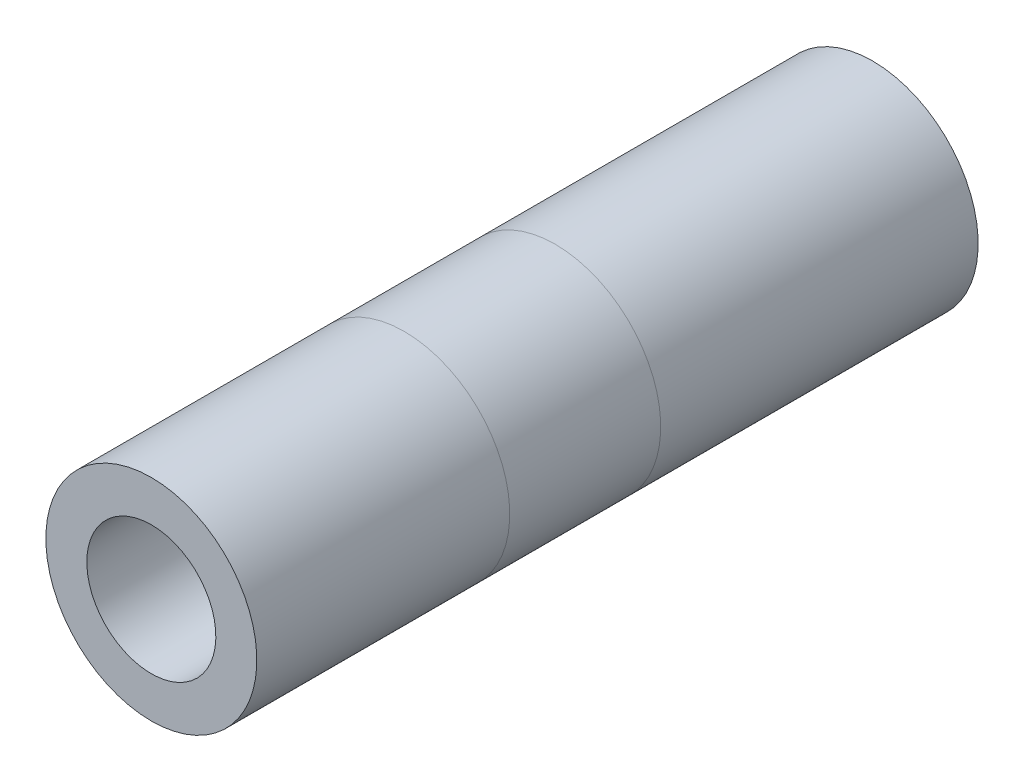
ISO-10303-21;
HEADER;
FILE_DESCRIPTION(('STEP AP214'),'2;1');
FILE_NAME('part.step','',(''),(''),'','','');
FILE_SCHEMA(('AUTOMOTIVE_DESIGN { 1 0 10303 214 1 1 1 1 }'));
ENDSEC;
DATA;
#1=APPLICATION_CONTEXT('core data for automotive mechanical design processes');
#2=APPLICATION_PROTOCOL_DEFINITION('international standard','automotive_design',2000,#1);
#3=PRODUCT_CONTEXT('',#1,'mechanical');
#4=PRODUCT('Part','Part','',(#3));
#5=PRODUCT_RELATED_PRODUCT_CATEGORY('part','',(#4));
#6=PRODUCT_DEFINITION_FORMATION('','',#4);
#7=PRODUCT_DEFINITION_CONTEXT('part definition',#1,'design');
#8=PRODUCT_DEFINITION('design','',#6,#7);
#9=PRODUCT_DEFINITION_SHAPE('','',#8);
#10=(LENGTH_UNIT() NAMED_UNIT(*) SI_UNIT(.MILLI.,.METRE.));
#11=(NAMED_UNIT(*) PLANE_ANGLE_UNIT() SI_UNIT($,.RADIAN.));
#12=(NAMED_UNIT(*) SI_UNIT($,.STERADIAN.) SOLID_ANGLE_UNIT());
#13=UNCERTAINTY_MEASURE_WITH_UNIT(LENGTH_MEASURE(1.E-05),#10,'distance_accuracy_value','');
#14=(GEOMETRIC_REPRESENTATION_CONTEXT(3) GLOBAL_UNCERTAINTY_ASSIGNED_CONTEXT((#13)) GLOBAL_UNIT_ASSIGNED_CONTEXT((#10,
#11,#12)) REPRESENTATION_CONTEXT('',''));
#15=CARTESIAN_POINT('',(0.,0.,0.));
#16=DIRECTION('',(0.,0.,1.));
#17=DIRECTION('',(1.,0.,0.));
#18=AXIS2_PLACEMENT_3D('',#15,#16,#17);
#19=CARTESIAN_POINT('',(-46.0299999999996,4.42627169165701E-13,31.3016264683147));
#20=DIRECTION('',(0.,0.,-1.));
#21=DIRECTION('',(0.,1.,0.));
#22=AXIS2_PLACEMENT_3D('',#19,#20,#21);
#23=PLANE('',#22);
#24=CARTESIAN_POINT('',(-46.0299999999996,4.42627169165701E-13,31.3016264683147));
#25=DIRECTION('',(0.,0.,-1.));
#26=DIRECTION('',(0.,1.,0.));
#27=AXIS2_PLACEMENT_3D('',#24,#25,#26);
#28=CIRCLE('',#27,5.);
#29=CARTESIAN_POINT('',(-46.0299999999996,5.00000000000044,31.3016264683147));
#30=VERTEX_POINT('',#29);
#31=EDGE_CURVE('E75',#30,#30,#28,.F.);
#32=ORIENTED_EDGE('',*,*,#31,.F.);
#33=EDGE_LOOP('',(#32));
#34=FACE_BOUND('',#33,.T.);
#35=CARTESIAN_POINT('',(-46.0299999999996,4.42627169165701E-13,31.3016264683147));
#36=DIRECTION('',(0.,0.,-1.));
#37=DIRECTION('',(0.,1.,0.));
#38=AXIS2_PLACEMENT_3D('',#35,#36,#37);
#39=CIRCLE('',#38,8.175);
#40=CARTESIAN_POINT('',(-46.0299999999996,8.17500000000044,31.3016264683147));
#41=VERTEX_POINT('',#40);
#42=EDGE_CURVE('E70',#41,#41,#39,.T.);
#43=ORIENTED_EDGE('',*,*,#42,.F.);
#44=EDGE_LOOP('',(#43));
#45=FACE_BOUND('',#44,.T.);
#46=ADVANCED_FACE('F56',(#34,#45),#23,.F.);
#47=CARTESIAN_POINT('',(-46.03,0.,-24.5999999999999));
#48=DIRECTION('',(0.,0.,-1.));
#49=DIRECTION('',(0.,1.,0.));
#50=AXIS2_PLACEMENT_3D('',#47,#48,#49);
#51=PLANE('',#50);
#52=CARTESIAN_POINT('',(-46.030000000001,-1.1393832554663E-12,-24.5999999999999));
#53=DIRECTION('',(0.,0.,-1.));
#54=DIRECTION('',(0.,1.,0.));
#55=AXIS2_PLACEMENT_3D('',#52,#53,#54);
#56=CIRCLE('',#55,5.);
#57=CARTESIAN_POINT('',(-46.030000000001,4.99999999999886,-24.5999999999999));
#58=VERTEX_POINT('',#57);
#59=EDGE_CURVE('E76',#58,#58,#56,.F.);
#60=ORIENTED_EDGE('',*,*,#59,.T.);
#61=EDGE_LOOP('',(#60));
#62=FACE_BOUND('',#61,.T.);
#63=CARTESIAN_POINT('',(-46.03,0.,-24.5999999999999));
#64=DIRECTION('',(0.,0.,-1.));
#65=DIRECTION('',(0.,1.,0.));
#66=AXIS2_PLACEMENT_3D('',#63,#64,#65);
#67=CIRCLE('',#66,8.175);
#68=CARTESIAN_POINT('',(-46.03,8.17500000000002,-24.5999999999999));
#69=VERTEX_POINT('',#68);
#70=EDGE_CURVE('E11',#69,#69,#67,.T.);
#71=ORIENTED_EDGE('',*,*,#70,.T.);
#72=EDGE_LOOP('',(#71));
#73=FACE_BOUND('',#72,.T.);
#74=ADVANCED_FACE('F93',(#62,#73),#51,.T.);
#75=CARTESIAN_POINT('',(-46.0299999999996,4.42627169165701E-13,31.3016264683147));
#76=DIRECTION('',(0.,0.,-1.));
#77=DIRECTION('',(-1.,0.,0.));
#78=AXIS2_PLACEMENT_3D('',#75,#76,#77);
#79=CYLINDRICAL_SURFACE('',#78,8.175);
#80=CARTESIAN_POINT('',(-46.0299999999996,4.32834212964584E-13,11.7000469580002));
#81=DIRECTION('',(0.,0.,-1.));
#82=DIRECTION('',(0.,1.,0.));
#83=AXIS2_PLACEMENT_3D('',#80,#81,#82);
#84=CIRCLE('',#83,8.175);
#85=CARTESIAN_POINT('',(-46.0299999999996,8.17500000000044,11.7000469580002));
#86=VERTEX_POINT('',#85);
#87=EDGE_CURVE('E66',#86,#86,#84,.T.);
#88=ORIENTED_EDGE('',*,*,#87,.F.);
#89=EDGE_LOOP('',(#88));
#90=FACE_BOUND('',#89,.T.);
#91=ORIENTED_EDGE('',*,*,#42,.T.);
#92=EDGE_LOOP('',(#91));
#93=FACE_BOUND('',#92,.T.);
#94=ADVANCED_FACE('F97',(#90,#93),#79,.T.);
#95=CARTESIAN_POINT('',(-46.0300000000006,-7.07353857110939E-13,11.7000469579987));
#96=DIRECTION('',(0.,0.,-1.));
#97=DIRECTION('',(0.,1.,0.));
#98=AXIS2_PLACEMENT_3D('',#95,#96,#97);
#99=CYLINDRICAL_SURFACE('',#98,8.175);
#100=CARTESIAN_POINT('',(-46.030000000001,-1.13938325546625E-12,-4.66293670342566E-12));
#101=DIRECTION('',(0.,0.,-1.));
#102=DIRECTION('',(0.,1.,0.));
#103=AXIS2_PLACEMENT_3D('',#100,#101,#102);
#104=CIRCLE('',#103,8.175);
#105=CARTESIAN_POINT('',(-46.030000000001,8.17499999999886,-4.6670209363775E-12));
#106=VERTEX_POINT('',#105);
#107=EDGE_CURVE('E62',#106,#106,#104,.T.);
#108=ORIENTED_EDGE('',*,*,#107,.F.);
#109=EDGE_LOOP('',(#108));
#110=FACE_BOUND('',#109,.T.);
#111=ORIENTED_EDGE('',*,*,#87,.T.);
#112=EDGE_LOOP('',(#111));
#113=FACE_BOUND('',#112,.T.);
#114=ADVANCED_FACE('F99',(#110,#113),#99,.T.);
#115=CARTESIAN_POINT('',(-46.03,0.,-3.09474668114262E-12));
#116=DIRECTION('',(0.,0.,-1.));
#117=DIRECTION('',(-1.,0.,0.));
#118=AXIS2_PLACEMENT_3D('',#115,#116,#117);
#119=CYLINDRICAL_SURFACE('',#118,8.175);
#120=ORIENTED_EDGE('',*,*,#70,.F.);
#121=EDGE_LOOP('',(#120));
#122=FACE_BOUND('',#121,.T.);
#123=ORIENTED_EDGE('',*,*,#107,.T.);
#124=EDGE_LOOP('',(#123));
#125=FACE_BOUND('',#124,.T.);
#126=ADVANCED_FACE('F106',(#122,#125),#119,.T.);
#127=CARTESIAN_POINT('',(-46.030000000001,-1.1393832554663E-12,-4.64905891561784E-12));
#128=DIRECTION('',(0.,0.,-1.));
#129=DIRECTION('',(-1.,0.,0.));
#130=AXIS2_PLACEMENT_3D('',#127,#128,#129);
#131=CYLINDRICAL_SURFACE('',#130,5.);
#132=CARTESIAN_POINT('',(-46.0300000000011,-1.1393832554663E-12,-4.69763117294519E-12));
#133=DIRECTION('',(0.,0.,-1.));
#134=DIRECTION('',(0.,1.,0.));
#135=AXIS2_PLACEMENT_3D('',#132,#133,#134);
#136=CIRCLE('',#135,5.);
#137=CARTESIAN_POINT('',(-46.0300000000011,4.99999999999886,-4.7001291747506E-12));
#138=VERTEX_POINT('',#137);
#139=EDGE_CURVE('E80',#138,#138,#136,.T.);
#140=ORIENTED_EDGE('',*,*,#139,.F.);
#141=EDGE_LOOP('',(#140));
#142=FACE_BOUND('',#141,.T.);
#143=ORIENTED_EDGE('',*,*,#59,.F.);
#144=EDGE_LOOP('',(#143));
#145=FACE_BOUND('',#144,.T.);
#146=ADVANCED_FACE('F94',(#142,#145),#131,.F.);
#147=CARTESIAN_POINT('',(-46.0299999999996,4.43126769526782E-13,32.3016264683147));
#148=DIRECTION('',(0.,0.,-1.));
#149=DIRECTION('',(-1.,0.,0.));
#150=AXIS2_PLACEMENT_3D('',#147,#148,#149);
#151=CYLINDRICAL_SURFACE('',#150,5.);
#152=ORIENTED_EDGE('',*,*,#31,.T.);
#153=EDGE_LOOP('',(#152));
#154=FACE_BOUND('',#153,.T.);
#155=CARTESIAN_POINT('',(-46.0299999999996,4.32834212964584E-13,11.7000469580002));
#156=DIRECTION('',(0.,0.,-1.));
#157=DIRECTION('',(0.,1.,0.));
#158=AXIS2_PLACEMENT_3D('',#155,#156,#157);
#159=CIRCLE('',#158,5.);
#160=CARTESIAN_POINT('',(-46.0299999999996,5.00000000000043,11.7000469580001));
#161=VERTEX_POINT('',#160);
#162=EDGE_CURVE('E79',#161,#161,#159,.T.);
#163=ORIENTED_EDGE('',*,*,#162,.T.);
#164=EDGE_LOOP('',(#163));
#165=FACE_BOUND('',#164,.T.);
#166=ADVANCED_FACE('F88',(#154,#165),#151,.F.);
#167=CARTESIAN_POINT('',(-46.0300000000007,-7.07353857110997E-13,11.7000469579986));
#168=DIRECTION('',(0.,0.,-1.));
#169=DIRECTION('',(0.,1.,0.));
#170=AXIS2_PLACEMENT_3D('',#167,#168,#169);
#171=CYLINDRICAL_SURFACE('',#170,5.);
#172=ORIENTED_EDGE('',*,*,#139,.T.);
#173=EDGE_LOOP('',(#172));
#174=FACE_BOUND('',#173,.T.);
#175=ORIENTED_EDGE('',*,*,#162,.F.);
#176=EDGE_LOOP('',(#175));
#177=FACE_BOUND('',#176,.T.);
#178=ADVANCED_FACE('F119',(#174,#177),#171,.F.);
#179=CLOSED_SHELL('',(#46,#74,#94,#114,#126,#146,#166,#178));
#180=MANIFOLD_SOLID_BREP('B2',#179);
#181=ADVANCED_BREP_SHAPE_REPRESENTATION('',(#18,#180),#14);
#182=SHAPE_DEFINITION_REPRESENTATION(#9,#181);
ENDSEC;
END-ISO-10303-21;
